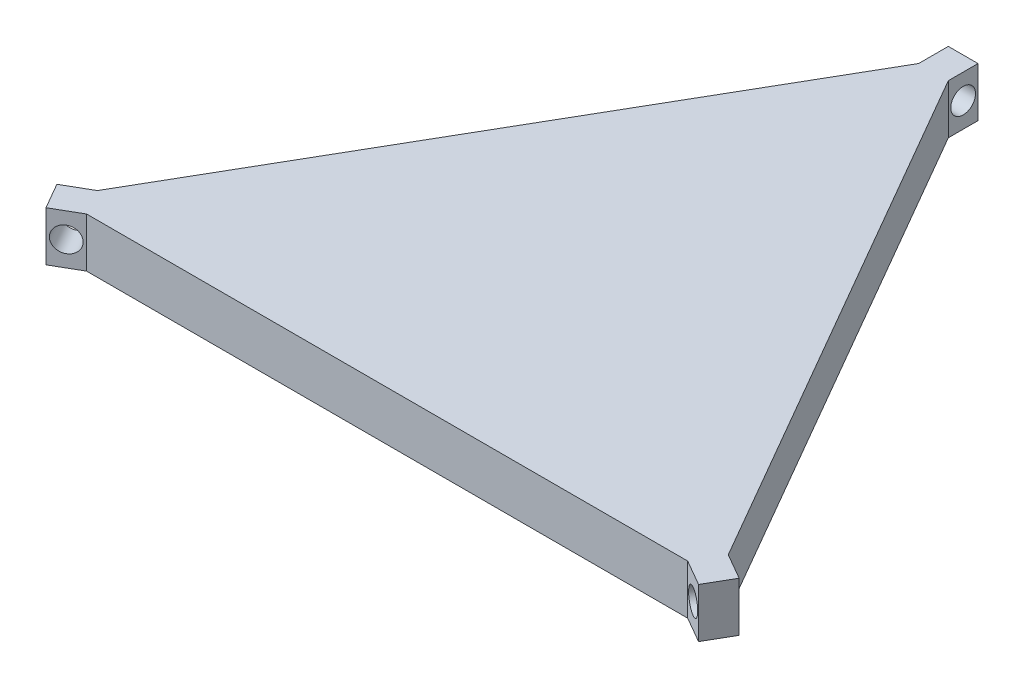
ISO-10303-21;
HEADER;
FILE_DESCRIPTION(('STEP AP214'),'2;1');
FILE_NAME('part.step','',(''),(''),'','','');
FILE_SCHEMA(('AUTOMOTIVE_DESIGN { 1 0 10303 214 1 1 1 1 }'));
ENDSEC;
DATA;
#1=APPLICATION_CONTEXT('core data for automotive mechanical design processes');
#2=APPLICATION_PROTOCOL_DEFINITION('international standard','automotive_design',2000,#1);
#3=PRODUCT_CONTEXT('',#1,'mechanical');
#4=PRODUCT('Part','Part','',(#3));
#5=PRODUCT_RELATED_PRODUCT_CATEGORY('part','',(#4));
#6=PRODUCT_DEFINITION_FORMATION('','',#4);
#7=PRODUCT_DEFINITION_CONTEXT('part definition',#1,'design');
#8=PRODUCT_DEFINITION('design','',#6,#7);
#9=PRODUCT_DEFINITION_SHAPE('','',#8);
#10=(LENGTH_UNIT() NAMED_UNIT(*) SI_UNIT(.MILLI.,.METRE.));
#11=(NAMED_UNIT(*) PLANE_ANGLE_UNIT() SI_UNIT($,.RADIAN.));
#12=(NAMED_UNIT(*) SI_UNIT($,.STERADIAN.) SOLID_ANGLE_UNIT());
#13=UNCERTAINTY_MEASURE_WITH_UNIT(LENGTH_MEASURE(1.E-05),#10,'distance_accuracy_value','');
#14=(GEOMETRIC_REPRESENTATION_CONTEXT(3) GLOBAL_UNCERTAINTY_ASSIGNED_CONTEXT((#13)) GLOBAL_UNIT_ASSIGNED_CONTEXT((#10,
#11,#12)) REPRESENTATION_CONTEXT('',''));
#15=CARTESIAN_POINT('',(0.,0.,0.));
#16=DIRECTION('',(0.,0.,1.));
#17=DIRECTION('',(1.,0.,0.));
#18=AXIS2_PLACEMENT_3D('',#15,#16,#17);
#19=CARTESIAN_POINT('',(-68.9261524226887,10.,-2.19615242271708));
#20=DIRECTION('',(0.866025403786171,0.,-0.499999999996999));
#21=DIRECTION('',(-0.499999999996999,0.,-0.866025403786171));
#22=AXIS2_PLACEMENT_3D('',#19,#20,#21);
#23=PLANE('',#22);
#24=DIRECTION('',(0.499999999996999,0.,0.866025403786171));
#25=VECTOR('',#24,1.);
#26=CARTESIAN_POINT('',(-68.9261524226887,0.,-2.19615242271708));
#27=LINE('',#26,#25);
#28=CARTESIAN_POINT('',(-68.9261524226887,0.,-2.19615242271708));
#29=VERTEX_POINT('',#28);
#30=CARTESIAN_POINT('',(-65.9261524227067,0.,2.99999999999994));
#31=VERTEX_POINT('',#30);
#32=EDGE_CURVE('E171',#29,#31,#27,.T.);
#33=ORIENTED_EDGE('',*,*,#32,.T.);
#34=DIRECTION('',(0.,-1.,0.));
#35=VECTOR('',#34,1.);
#36=CARTESIAN_POINT('',(-65.9261524227067,10.,2.99999999999994));
#37=LINE('',#36,#35);
#38=CARTESIAN_POINT('',(-65.9261524227067,10.,2.99999999999994));
#39=VERTEX_POINT('',#38);
#40=EDGE_CURVE('E11',#39,#31,#37,.T.);
#41=ORIENTED_EDGE('',*,*,#40,.F.);
#42=DIRECTION('',(0.499999999996999,0.,0.866025403786171));
#43=VECTOR('',#42,1.);
#44=CARTESIAN_POINT('',(-68.9261524226887,10.,-2.19615242271708));
#45=LINE('',#44,#43);
#46=CARTESIAN_POINT('',(-68.9261524226887,10.,-2.19615242271708));
#47=VERTEX_POINT('',#46);
#48=EDGE_CURVE('E206',#47,#39,#45,.T.);
#49=ORIENTED_EDGE('',*,*,#48,.F.);
#50=DIRECTION('',(0.,-1.,0.));
#51=VECTOR('',#50,1.);
#52=CARTESIAN_POINT('',(-68.9261524226887,10.,-2.19615242271708));
#53=LINE('',#52,#51);
#54=EDGE_CURVE('E167',#47,#29,#53,.T.);
#55=ORIENTED_EDGE('',*,*,#54,.T.);
#56=EDGE_LOOP('',(#33,#41,#49,#55));
#57=FACE_BOUND('',#56,.T.);
#58=ADVANCED_FACE('F45',(#57),#23,.F.);
#59=CARTESIAN_POINT('',(-60.73,10.,0.));
#60=DIRECTION('',(-0.499999999999991,0.,-0.866025403784444));
#61=DIRECTION('',(-0.866025403784444,0.,0.499999999999991));
#62=AXIS2_PLACEMENT_3D('',#59,#60,#61);
#63=PLANE('',#62);
#64=CARTESIAN_POINT('',(-63.3280762113533,5.,1.50000000000004));
#65=DIRECTION('',(0.499999999999992,0.,0.866025403784443));
#66=DIRECTION('',(0.866025403784443,0.,-0.499999999999992));
#67=AXIS2_PLACEMENT_3D('',#64,#65,#66);
#68=CIRCLE('',#67,2.5);
#69=CARTESIAN_POINT('',(-61.1630127018922,5.,0.250000000000062));
#70=VERTEX_POINT('',#69);
#71=EDGE_CURVE('E354',#70,#70,#68,.T.);
#72=ORIENTED_EDGE('',*,*,#71,.F.);
#73=EDGE_LOOP('',(#72));
#74=FACE_BOUND('',#73,.T.);
#75=DIRECTION('',(0.866025403784444,0.,-0.499999999999991));
#76=VECTOR('',#75,1.);
#77=CARTESIAN_POINT('',(-60.73,0.,0.));
#78=LINE('',#77,#76);
#79=CARTESIAN_POINT('',(-60.73,0.,0.));
#80=VERTEX_POINT('',#79);
#81=EDGE_CURVE('E175',#31,#80,#78,.T.);
#82=ORIENTED_EDGE('',*,*,#81,.T.);
#83=DIRECTION('',(0.,-1.,0.));
#84=VECTOR('',#83,1.);
#85=CARTESIAN_POINT('',(-60.73,10.,0.));
#86=LINE('',#85,#84);
#87=CARTESIAN_POINT('',(-60.73,10.,0.));
#88=VERTEX_POINT('',#87);
#89=EDGE_CURVE('E55',#88,#80,#86,.T.);
#90=ORIENTED_EDGE('',*,*,#89,.F.);
#91=DIRECTION('',(0.866025403784444,0.,-0.499999999999991));
#92=VECTOR('',#91,1.);
#93=CARTESIAN_POINT('',(-60.73,10.,0.));
#94=LINE('',#93,#92);
#95=EDGE_CURVE('E118',#39,#88,#94,.T.);
#96=ORIENTED_EDGE('',*,*,#95,.F.);
#97=ORIENTED_EDGE('',*,*,#40,.T.);
#98=EDGE_LOOP('',(#82,#90,#96,#97));
#99=FACE_BOUND('',#98,.T.);
#100=ADVANCED_FACE('F305',(#74,#99),#63,.F.);
#101=CARTESIAN_POINT('',(-60.73,10.,0.));
#102=DIRECTION('',(0.,0.,-1.));
#103=DIRECTION('',(-1.,0.,0.));
#104=AXIS2_PLACEMENT_3D('',#101,#102,#103);
#105=PLANE('',#104);
#106=DIRECTION('',(1.,0.,0.));
#107=VECTOR('',#106,1.);
#108=CARTESIAN_POINT('',(-60.73,0.,0.));
#109=LINE('',#108,#107);
#110=CARTESIAN_POINT('',(60.73,0.,0.));
#111=VERTEX_POINT('',#110);
#112=EDGE_CURVE('E179',#80,#111,#109,.T.);
#113=ORIENTED_EDGE('',*,*,#112,.T.);
#114=DIRECTION('',(0.,-1.,0.));
#115=VECTOR('',#114,1.);
#116=CARTESIAN_POINT('',(60.73,10.,0.));
#117=LINE('',#116,#115);
#118=CARTESIAN_POINT('',(60.73,10.,0.));
#119=VERTEX_POINT('',#118);
#120=EDGE_CURVE('E233',#119,#111,#117,.T.);
#121=ORIENTED_EDGE('',*,*,#120,.F.);
#122=DIRECTION('',(1.,0.,0.));
#123=VECTOR('',#122,1.);
#124=CARTESIAN_POINT('',(-60.73,10.,0.));
#125=LINE('',#124,#123);
#126=EDGE_CURVE('E244',#88,#119,#125,.T.);
#127=ORIENTED_EDGE('',*,*,#126,.F.);
#128=ORIENTED_EDGE('',*,*,#89,.T.);
#129=EDGE_LOOP('',(#113,#121,#127,#128));
#130=FACE_BOUND('',#129,.T.);
#131=ADVANCED_FACE('F242',(#130),#105,.F.);
#132=CARTESIAN_POINT('',(60.73,10.,0.));
#133=DIRECTION('',(0.500000000000014,0.,-0.86602540378443));
#134=DIRECTION('',(-0.86602540378443,0.,-0.500000000000014));
#135=AXIS2_PLACEMENT_3D('',#132,#133,#134);
#136=PLANE('',#135);
#137=CARTESIAN_POINT('',(63.3280762113543,5.,1.49999999995783));
#138=DIRECTION('',(0.499999999999415,0.,-0.866025403784777));
#139=DIRECTION('',(-0.866025403784777,0.,-0.499999999999415));
#140=AXIS2_PLACEMENT_3D('',#137,#138,#139);
#141=CIRCLE('',#140,2.5);
#142=CARTESIAN_POINT('',(61.1630127018924,5.,0.249999999959293));
#143=VERTEX_POINT('',#142);
#144=EDGE_CURVE('E348',#143,#143,#141,.T.);
#145=ORIENTED_EDGE('',*,*,#144,.T.);
#146=EDGE_LOOP('',(#145));
#147=FACE_BOUND('',#146,.T.);
#148=DIRECTION('',(0.86602540378443,0.,0.500000000000014));
#149=VECTOR('',#148,1.);
#150=CARTESIAN_POINT('',(60.73,0.,0.));
#151=LINE('',#150,#149);
#152=CARTESIAN_POINT('',(65.9261524227066,0.,3.00000000000008));
#153=VERTEX_POINT('',#152);
#154=EDGE_CURVE('E182',#111,#153,#151,.T.);
#155=ORIENTED_EDGE('',*,*,#154,.T.);
#156=DIRECTION('',(0.,-1.,0.));
#157=VECTOR('',#156,1.);
#158=CARTESIAN_POINT('',(65.9261524227066,10.,3.00000000000008));
#159=LINE('',#158,#157);
#160=CARTESIAN_POINT('',(65.9261524227066,10.,3.00000000000008));
#161=VERTEX_POINT('',#160);
#162=EDGE_CURVE('E229',#161,#153,#159,.T.);
#163=ORIENTED_EDGE('',*,*,#162,.F.);
#164=DIRECTION('',(0.86602540378443,0.,0.500000000000014));
#165=VECTOR('',#164,1.);
#166=CARTESIAN_POINT('',(60.73,10.,0.));
#167=LINE('',#166,#165);
#168=EDGE_CURVE('E263',#119,#161,#167,.T.);
#169=ORIENTED_EDGE('',*,*,#168,.F.);
#170=ORIENTED_EDGE('',*,*,#120,.T.);
#171=EDGE_LOOP('',(#155,#163,#169,#170));
#172=FACE_BOUND('',#171,.T.);
#173=ADVANCED_FACE('F253',(#147,#172),#136,.F.);
#174=CARTESIAN_POINT('',(65.9261524227066,10.,3.00000000000008));
#175=DIRECTION('',(-0.866025403785753,0.,-0.499999999997723));
#176=DIRECTION('',(-0.499999999997723,0.,0.866025403785753));
#177=AXIS2_PLACEMENT_3D('',#174,#175,#176);
#178=PLANE('',#177);
#179=DIRECTION('',(0.499999999997723,0.,-0.866025403785753));
#180=VECTOR('',#179,1.);
#181=CARTESIAN_POINT('',(65.9261524227066,0.,3.00000000000008));
#182=LINE('',#181,#180);
#183=CARTESIAN_POINT('',(68.9261524226929,0.,-2.19615242271443));
#184=VERTEX_POINT('',#183);
#185=EDGE_CURVE('E185',#153,#184,#182,.T.);
#186=ORIENTED_EDGE('',*,*,#185,.T.);
#187=DIRECTION('',(0.,-1.,0.));
#188=VECTOR('',#187,1.);
#189=CARTESIAN_POINT('',(68.9261524226929,10.,-2.19615242271443));
#190=LINE('',#189,#188);
#191=CARTESIAN_POINT('',(68.9261524226929,10.,-2.19615242271443));
#192=VERTEX_POINT('',#191);
#193=EDGE_CURVE('E225',#192,#184,#190,.T.);
#194=ORIENTED_EDGE('',*,*,#193,.F.);
#195=DIRECTION('',(0.499999999997723,0.,-0.866025403785753));
#196=VECTOR('',#195,1.);
#197=CARTESIAN_POINT('',(65.9261524227066,10.,3.00000000000008));
#198=LINE('',#197,#196);
#199=EDGE_CURVE('E259',#161,#192,#198,.T.);
#200=ORIENTED_EDGE('',*,*,#199,.F.);
#201=ORIENTED_EDGE('',*,*,#162,.T.);
#202=EDGE_LOOP('',(#186,#194,#200,#201));
#203=FACE_BOUND('',#202,.T.);
#204=ADVANCED_FACE('F257',(#203),#178,.F.);
#205=CARTESIAN_POINT('',(63.7299999999882,10.,-5.19615242271771));
#206=DIRECTION('',(-0.500000000000548,0.,0.866025403784122));
#207=DIRECTION('',(0.866025403784122,0.,0.500000000000548));
#208=AXIS2_PLACEMENT_3D('',#205,#206,#207);
#209=PLANE('',#208);
#210=CARTESIAN_POINT('',(66.3280762113332,5.,-3.69615242272033));
#211=DIRECTION('',(-0.500000000000548,0.,0.866025403784122));
#212=DIRECTION('',(0.866025403784122,0.,0.500000000000548));
#213=AXIS2_PLACEMENT_3D('',#210,#211,#212);
#214=CIRCLE('',#213,2.5);
#215=CARTESIAN_POINT('',(68.4931397207935,5.,-2.44615242271895));
#216=VERTEX_POINT('',#215);
#217=EDGE_CURVE('E48',#216,#216,#214,.F.);
#218=ORIENTED_EDGE('',*,*,#217,.F.);
#219=EDGE_LOOP('',(#218));
#220=FACE_BOUND('',#219,.T.);
#221=DIRECTION('',(-0.866025403784122,0.,-0.500000000000548));
#222=VECTOR('',#221,1.);
#223=CARTESIAN_POINT('',(63.7299999999882,0.,-5.19615242271771));
#224=LINE('',#223,#222);
#225=CARTESIAN_POINT('',(63.7299999999882,0.,-5.19615242271771));
#226=VERTEX_POINT('',#225);
#227=EDGE_CURVE('E188',#184,#226,#224,.T.);
#228=ORIENTED_EDGE('',*,*,#227,.T.);
#229=DIRECTION('',(0.,-1.,0.));
#230=VECTOR('',#229,1.);
#231=CARTESIAN_POINT('',(63.7299999999882,10.,-5.19615242271771));
#232=LINE('',#231,#230);
#233=CARTESIAN_POINT('',(63.7299999999882,10.,-5.19615242271771));
#234=VERTEX_POINT('',#233);
#235=EDGE_CURVE('E221',#234,#226,#232,.T.);
#236=ORIENTED_EDGE('',*,*,#235,.F.);
#237=DIRECTION('',(-0.866025403784122,0.,-0.500000000000548));
#238=VECTOR('',#237,1.);
#239=CARTESIAN_POINT('',(63.7299999999882,10.,-5.19615242271771));
#240=LINE('',#239,#238);
#241=EDGE_CURVE('E262',#192,#234,#240,.T.);
#242=ORIENTED_EDGE('',*,*,#241,.F.);
#243=ORIENTED_EDGE('',*,*,#193,.T.);
#244=EDGE_LOOP('',(#228,#236,#242,#243));
#245=FACE_BOUND('',#244,.T.);
#246=ADVANCED_FACE('F321',(#220,#245),#209,.F.);
#247=CARTESIAN_POINT('',(3.00000000005743,10.,-110.383597966416));
#248=DIRECTION('',(-0.866025403784768,0.,0.49999999999943));
#249=DIRECTION('',(0.49999999999943,0.,0.866025403784768));
#250=AXIS2_PLACEMENT_3D('',#247,#248,#249);
#251=PLANE('',#250);
#252=DIRECTION('',(-0.49999999999943,0.,-0.866025403784768));
#253=VECTOR('',#252,1.);
#254=CARTESIAN_POINT('',(3.00000000005743,0.,-110.383597966416));
#255=LINE('',#254,#253);
#256=CARTESIAN_POINT('',(3.00000000005743,0.,-110.383597966416));
#257=VERTEX_POINT('',#256);
#258=EDGE_CURVE('E191',#226,#257,#255,.T.);
#259=ORIENTED_EDGE('',*,*,#258,.T.);
#260=DIRECTION('',(0.,-1.,0.));
#261=VECTOR('',#260,1.);
#262=CARTESIAN_POINT('',(3.00000000005743,10.,-110.383597966416));
#263=LINE('',#262,#261);
#264=CARTESIAN_POINT('',(3.00000000005743,10.,-110.383597966416));
#265=VERTEX_POINT('',#264);
#266=EDGE_CURVE('E217',#265,#257,#263,.T.);
#267=ORIENTED_EDGE('',*,*,#266,.F.);
#268=DIRECTION('',(-0.49999999999943,0.,-0.866025403784768));
#269=VECTOR('',#268,1.);
#270=CARTESIAN_POINT('',(3.00000000005743,10.,-110.383597966416));
#271=LINE('',#270,#269);
#272=EDGE_CURVE('E267',#234,#265,#271,.T.);
#273=ORIENTED_EDGE('',*,*,#272,.F.);
#274=ORIENTED_EDGE('',*,*,#235,.T.);
#275=EDGE_LOOP('',(#259,#267,#273,#274));
#276=FACE_BOUND('',#275,.T.);
#277=ADVANCED_FACE('F324',(#276),#251,.F.);
#278=CARTESIAN_POINT('',(3.00000000005743,10.,-110.383597966416));
#279=DIRECTION('',(-1.,0.,1.35928594768852E-11));
#280=DIRECTION('',(1.35928594768852E-11,0.,1.));
#281=AXIS2_PLACEMENT_3D('',#278,#279,#280);
#282=PLANE('',#281);
#283=CARTESIAN_POINT('',(3.00000000001665,5.,-113.383597966377));
#284=DIRECTION('',(-1.,0.,1.35928594768852E-11));
#285=DIRECTION('',(1.35928594768852E-11,0.,1.));
#286=AXIS2_PLACEMENT_3D('',#283,#284,#285);
#287=CIRCLE('',#286,2.5);
#288=CARTESIAN_POINT('',(3.00000000005063,5.,-110.883597966377));
#289=VERTEX_POINT('',#288);
#290=EDGE_CURVE('E344',#289,#289,#287,.F.);
#291=ORIENTED_EDGE('',*,*,#290,.F.);
#292=EDGE_LOOP('',(#291));
#293=FACE_BOUND('',#292,.T.);
#294=DIRECTION('',(-1.35928594768852E-11,0.,-1.));
#295=VECTOR('',#294,1.);
#296=CARTESIAN_POINT('',(3.00000000005743,0.,-110.383597966416));
#297=LINE('',#296,#295);
#298=CARTESIAN_POINT('',(2.99999999997587,0.,-116.383597966416));
#299=VERTEX_POINT('',#298);
#300=EDGE_CURVE('E194',#257,#299,#297,.T.);
#301=ORIENTED_EDGE('',*,*,#300,.T.);
#302=DIRECTION('',(0.,-1.,0.));
#303=VECTOR('',#302,1.);
#304=CARTESIAN_POINT('',(2.99999999997587,10.,-116.383597966416));
#305=LINE('',#304,#303);
#306=CARTESIAN_POINT('',(2.99999999997587,10.,-116.383597966416));
#307=VERTEX_POINT('',#306);
#308=EDGE_CURVE('E213',#307,#299,#305,.T.);
#309=ORIENTED_EDGE('',*,*,#308,.F.);
#310=DIRECTION('',(-1.35928594768852E-11,0.,-1.));
#311=VECTOR('',#310,1.);
#312=CARTESIAN_POINT('',(3.00000000005743,10.,-110.383597966416));
#313=LINE('',#312,#311);
#314=EDGE_CURVE('E274',#265,#307,#313,.T.);
#315=ORIENTED_EDGE('',*,*,#314,.F.);
#316=ORIENTED_EDGE('',*,*,#266,.T.);
#317=EDGE_LOOP('',(#301,#309,#315,#316));
#318=FACE_BOUND('',#317,.T.);
#319=ADVANCED_FACE('F282',(#293,#318),#282,.F.);
#320=CARTESIAN_POINT('',(2.99999999997587,10.,-116.383597966416));
#321=DIRECTION('',(6.26350823059359E-12,0.,1.));
#322=DIRECTION('',(1.,0.,-6.26350823059359E-12));
#323=AXIS2_PLACEMENT_3D('',#320,#321,#322);
#324=PLANE('',#323);
#325=DIRECTION('',(-1.,0.,6.26350823059359E-12));
#326=VECTOR('',#325,1.);
#327=CARTESIAN_POINT('',(2.99999999997587,0.,-116.383597966416));
#328=LINE('',#327,#326);
#329=CARTESIAN_POINT('',(-3.00000000002413,0.,-116.383597966378));
#330=VERTEX_POINT('',#329);
#331=EDGE_CURVE('E197',#299,#330,#328,.T.);
#332=ORIENTED_EDGE('',*,*,#331,.T.);
#333=DIRECTION('',(0.,-1.,0.));
#334=VECTOR('',#333,1.);
#335=CARTESIAN_POINT('',(-3.00000000002413,10.,-116.383597966378));
#336=LINE('',#335,#334);
#337=CARTESIAN_POINT('',(-3.00000000002413,10.,-116.383597966378));
#338=VERTEX_POINT('',#337);
#339=EDGE_CURVE('E160',#338,#330,#336,.T.);
#340=ORIENTED_EDGE('',*,*,#339,.F.);
#341=DIRECTION('',(-1.,0.,6.26350823059359E-12));
#342=VECTOR('',#341,1.);
#343=CARTESIAN_POINT('',(2.99999999997587,10.,-116.383597966416));
#344=LINE('',#343,#342);
#345=EDGE_CURVE('E149',#307,#338,#344,.T.);
#346=ORIENTED_EDGE('',*,*,#345,.F.);
#347=ORIENTED_EDGE('',*,*,#308,.T.);
#348=EDGE_LOOP('',(#332,#340,#346,#347));
#349=FACE_BOUND('',#348,.T.);
#350=ADVANCED_FACE('F286',(#349),#324,.F.);
#351=CARTESIAN_POINT('',(-2.99999999998655,10.,-110.383597966378));
#352=DIRECTION('',(1.,0.,-6.26300226957976E-12));
#353=DIRECTION('',(-6.26300226957976E-12,0.,-1.));
#354=AXIS2_PLACEMENT_3D('',#351,#352,#353);
#355=PLANE('',#354);
#356=CARTESIAN_POINT('',(-2.99999999928307,5.,-113.383597966378));
#357=DIRECTION('',(-1.,0.,-1.07119174641568E-13));
#358=DIRECTION('',(-1.07119174641568E-13,0.,1.));
#359=AXIS2_PLACEMENT_3D('',#356,#357,#358);
#360=CIRCLE('',#359,2.5);
#361=CARTESIAN_POINT('',(-2.99999999928334,5.,-110.883597966378));
#362=VERTEX_POINT('',#361);
#363=EDGE_CURVE('E341',#362,#362,#360,.T.);
#364=ORIENTED_EDGE('',*,*,#363,.F.);
#365=EDGE_LOOP('',(#364));
#366=FACE_BOUND('',#365,.T.);
#367=DIRECTION('',(6.26300226957976E-12,0.,1.));
#368=VECTOR('',#367,1.);
#369=CARTESIAN_POINT('',(-2.99999999998655,0.,-110.383597966378));
#370=LINE('',#369,#368);
#371=CARTESIAN_POINT('',(-2.99999999998655,0.,-110.383597966378));
#372=VERTEX_POINT('',#371);
#373=EDGE_CURVE('E158',#330,#372,#370,.T.);
#374=ORIENTED_EDGE('',*,*,#373,.T.);
#375=DIRECTION('',(0.,-1.,0.));
#376=VECTOR('',#375,1.);
#377=CARTESIAN_POINT('',(-2.99999999998655,10.,-110.383597966378));
#378=LINE('',#377,#376);
#379=CARTESIAN_POINT('',(-2.99999999998655,10.,-110.383597966378));
#380=VERTEX_POINT('',#379);
#381=EDGE_CURVE('E155',#380,#372,#378,.T.);
#382=ORIENTED_EDGE('',*,*,#381,.F.);
#383=DIRECTION('',(6.26300226957976E-12,0.,1.));
#384=VECTOR('',#383,1.);
#385=CARTESIAN_POINT('',(-2.99999999998655,10.,-110.383597966378));
#386=LINE('',#385,#384);
#387=EDGE_CURVE('E143',#338,#380,#386,.T.);
#388=ORIENTED_EDGE('',*,*,#387,.F.);
#389=ORIENTED_EDGE('',*,*,#339,.T.);
#390=EDGE_LOOP('',(#374,#382,#388,#389));
#391=FACE_BOUND('',#390,.T.);
#392=ADVANCED_FACE('F156',(#366,#391),#355,.F.);
#393=CARTESIAN_POINT('',(-2.99999999998655,10.,-110.383597966378));
#394=DIRECTION('',(0.866025403784458,0.,0.499999999999966));
#395=DIRECTION('',(0.499999999999966,0.,-0.866025403784458));
#396=AXIS2_PLACEMENT_3D('',#393,#394,#395);
#397=PLANE('',#396);
#398=DIRECTION('',(-0.499999999999966,0.,0.866025403784458));
#399=VECTOR('',#398,1.);
#400=CARTESIAN_POINT('',(-2.99999999998655,0.,-110.383597966378));
#401=LINE('',#400,#399);
#402=CARTESIAN_POINT('',(-63.7299999999824,0.,-5.19615242271771));
#403=VERTEX_POINT('',#402);
#404=EDGE_CURVE('E104',#372,#403,#401,.T.);
#405=ORIENTED_EDGE('',*,*,#404,.T.);
#406=DIRECTION('',(0.,-1.,0.));
#407=VECTOR('',#406,1.);
#408=CARTESIAN_POINT('',(-63.7299999999824,10.,-5.19615242271771));
#409=LINE('',#408,#407);
#410=CARTESIAN_POINT('',(-63.7299999999824,10.,-5.19615242271771));
#411=VERTEX_POINT('',#410);
#412=EDGE_CURVE('E161',#411,#403,#409,.T.);
#413=ORIENTED_EDGE('',*,*,#412,.F.);
#414=DIRECTION('',(-0.499999999999966,0.,0.866025403784458));
#415=VECTOR('',#414,1.);
#416=CARTESIAN_POINT('',(-2.99999999998655,10.,-110.383597966378));
#417=LINE('',#416,#415);
#418=EDGE_CURVE('E147',#380,#411,#417,.T.);
#419=ORIENTED_EDGE('',*,*,#418,.F.);
#420=ORIENTED_EDGE('',*,*,#381,.T.);
#421=EDGE_LOOP('',(#405,#413,#419,#420));
#422=FACE_BOUND('',#421,.T.);
#423=ADVANCED_FACE('F163',(#422),#397,.F.);
#424=CARTESIAN_POINT('',(-63.7299999999824,10.,-5.19615242271771));
#425=DIRECTION('',(0.500000000000105,0.,0.866025403784378));
#426=DIRECTION('',(0.866025403784378,0.,-0.500000000000105));
#427=AXIS2_PLACEMENT_3D('',#424,#425,#426);
#428=PLANE('',#427);
#429=CARTESIAN_POINT('',(-66.3280762113535,5.,-3.69615242270702));
#430=DIRECTION('',(0.500000000000105,0.,0.866025403784378));
#431=DIRECTION('',(0.866025403784378,0.,-0.500000000000105));
#432=AXIS2_PLACEMENT_3D('',#429,#430,#431);
#433=CIRCLE('',#432,2.5);
#434=CARTESIAN_POINT('',(-64.1630127018926,5.,-4.94615242270729));
#435=VERTEX_POINT('',#434);
#436=EDGE_CURVE('E176',#435,#435,#433,.F.);
#437=ORIENTED_EDGE('',*,*,#436,.F.);
#438=EDGE_LOOP('',(#437));
#439=FACE_BOUND('',#438,.T.);
#440=DIRECTION('',(-0.866025403784378,0.,0.500000000000105));
#441=VECTOR('',#440,1.);
#442=CARTESIAN_POINT('',(-63.7299999999824,0.,-5.19615242271771));
#443=LINE('',#442,#441);
#444=EDGE_CURVE('E110',#403,#29,#443,.T.);
#445=ORIENTED_EDGE('',*,*,#444,.T.);
#446=ORIENTED_EDGE('',*,*,#54,.F.);
#447=DIRECTION('',(-0.866025403784378,0.,0.500000000000105));
#448=VECTOR('',#447,1.);
#449=CARTESIAN_POINT('',(-63.7299999999824,10.,-5.19615242271771));
#450=LINE('',#449,#448);
#451=EDGE_CURVE('E63',#411,#47,#450,.T.);
#452=ORIENTED_EDGE('',*,*,#451,.F.);
#453=ORIENTED_EDGE('',*,*,#412,.T.);
#454=EDGE_LOOP('',(#445,#446,#452,#453));
#455=FACE_BOUND('',#454,.T.);
#456=ADVANCED_FACE('F290',(#439,#455),#428,.F.);
#457=CARTESIAN_POINT('',(0.,10.,0.));
#458=DIRECTION('',(0.,-1.,0.));
#459=DIRECTION('',(0.,0.,-1.));
#460=AXIS2_PLACEMENT_3D('',#457,#458,#459);
#461=PLANE('',#460);
#462=ORIENTED_EDGE('',*,*,#48,.T.);
#463=ORIENTED_EDGE('',*,*,#95,.T.);
#464=ORIENTED_EDGE('',*,*,#126,.T.);
#465=ORIENTED_EDGE('',*,*,#168,.T.);
#466=ORIENTED_EDGE('',*,*,#199,.T.);
#467=ORIENTED_EDGE('',*,*,#241,.T.);
#468=ORIENTED_EDGE('',*,*,#272,.T.);
#469=ORIENTED_EDGE('',*,*,#314,.T.);
#470=ORIENTED_EDGE('',*,*,#345,.T.);
#471=ORIENTED_EDGE('',*,*,#387,.T.);
#472=ORIENTED_EDGE('',*,*,#418,.T.);
#473=ORIENTED_EDGE('',*,*,#451,.T.);
#474=EDGE_LOOP('',(#462,#463,#464,#465,#466,#467,#468,#469,#470,#471,#472,#473));
#475=FACE_BOUND('',#474,.T.);
#476=ADVANCED_FACE('F145',(#475),#461,.F.);
#477=CARTESIAN_POINT('',(0.,0.,0.));
#478=DIRECTION('',(0.,-1.,0.));
#479=DIRECTION('',(0.,0.,-1.));
#480=AXIS2_PLACEMENT_3D('',#477,#478,#479);
#481=PLANE('',#480);
#482=ORIENTED_EDGE('',*,*,#32,.F.);
#483=ORIENTED_EDGE('',*,*,#444,.F.);
#484=ORIENTED_EDGE('',*,*,#404,.F.);
#485=ORIENTED_EDGE('',*,*,#373,.F.);
#486=ORIENTED_EDGE('',*,*,#331,.F.);
#487=ORIENTED_EDGE('',*,*,#300,.F.);
#488=ORIENTED_EDGE('',*,*,#258,.F.);
#489=ORIENTED_EDGE('',*,*,#227,.F.);
#490=ORIENTED_EDGE('',*,*,#185,.F.);
#491=ORIENTED_EDGE('',*,*,#154,.F.);
#492=ORIENTED_EDGE('',*,*,#112,.F.);
#493=ORIENTED_EDGE('',*,*,#81,.F.);
#494=EDGE_LOOP('',(#482,#483,#484,#485,#486,#487,#488,#489,#490,#491,#492,#493));
#495=FACE_BOUND('',#494,.T.);
#496=ADVANCED_FACE('F248',(#495),#481,.T.);
#497=CARTESIAN_POINT('',(-69.8636101172862,5.,-9.81987677966501));
#498=DIRECTION('',(0.499999999999992,0.,0.866025403784443));
#499=DIRECTION('',(0.866025403784443,0.,-0.499999999999992));
#500=AXIS2_PLACEMENT_3D('',#497,#498,#499);
#501=CYLINDRICAL_SURFACE('',#500,2.5);
#502=ORIENTED_EDGE('',*,*,#436,.T.);
#503=EDGE_LOOP('',(#502));
#504=FACE_BOUND('',#503,.T.);
#505=ORIENTED_EDGE('',*,*,#71,.T.);
#506=EDGE_LOOP('',(#505));
#507=FACE_BOUND('',#506,.T.);
#508=ADVANCED_FACE('F375',(#504,#507),#501,.F.);
#509=CARTESIAN_POINT('',(137.959453281427,5.,-127.765336924441));
#510=DIRECTION('',(-0.499999999999415,0.,0.866025403784777));
#511=DIRECTION('',(0.866025403784777,0.,0.499999999999415));
#512=AXIS2_PLACEMENT_3D('',#509,#510,#511);
#513=CYLINDRICAL_SURFACE('',#512,2.5);
#514=ORIENTED_EDGE('',*,*,#144,.F.);
#515=EDGE_LOOP('',(#514));
#516=FACE_BOUND('',#515,.T.);
#517=ORIENTED_EDGE('',*,*,#217,.T.);
#518=EDGE_LOOP('',(#517));
#519=FACE_BOUND('',#518,.T.);
#520=ADVANCED_FACE('F369',(#516,#519),#513,.F.);
#521=CARTESIAN_POINT('',(10.0710678118824,5.,-113.383597966377));
#522=DIRECTION('',(-1.,0.,-1.07119174641568E-13));
#523=DIRECTION('',(-1.07119174641568E-13,0.,1.));
#524=AXIS2_PLACEMENT_3D('',#521,#522,#523);
#525=CYLINDRICAL_SURFACE('',#524,2.5);
#526=ORIENTED_EDGE('',*,*,#290,.T.);
#527=EDGE_LOOP('',(#526));
#528=FACE_BOUND('',#527,.T.);
#529=ORIENTED_EDGE('',*,*,#363,.T.);
#530=EDGE_LOOP('',(#529));
#531=FACE_BOUND('',#530,.T.);
#532=ADVANCED_FACE('F374',(#528,#531),#525,.F.);
#533=CLOSED_SHELL('',(#58,#100,#131,#173,#204,#246,#277,#319,#350,#392,#423,#456,#476,#496,#508,
#520,#532));
#534=MANIFOLD_SOLID_BREP('B2',#533);
#535=ADVANCED_BREP_SHAPE_REPRESENTATION('',(#18,#534),#14);
#536=SHAPE_DEFINITION_REPRESENTATION(#9,#535);
ENDSEC;
END-ISO-10303-21;
